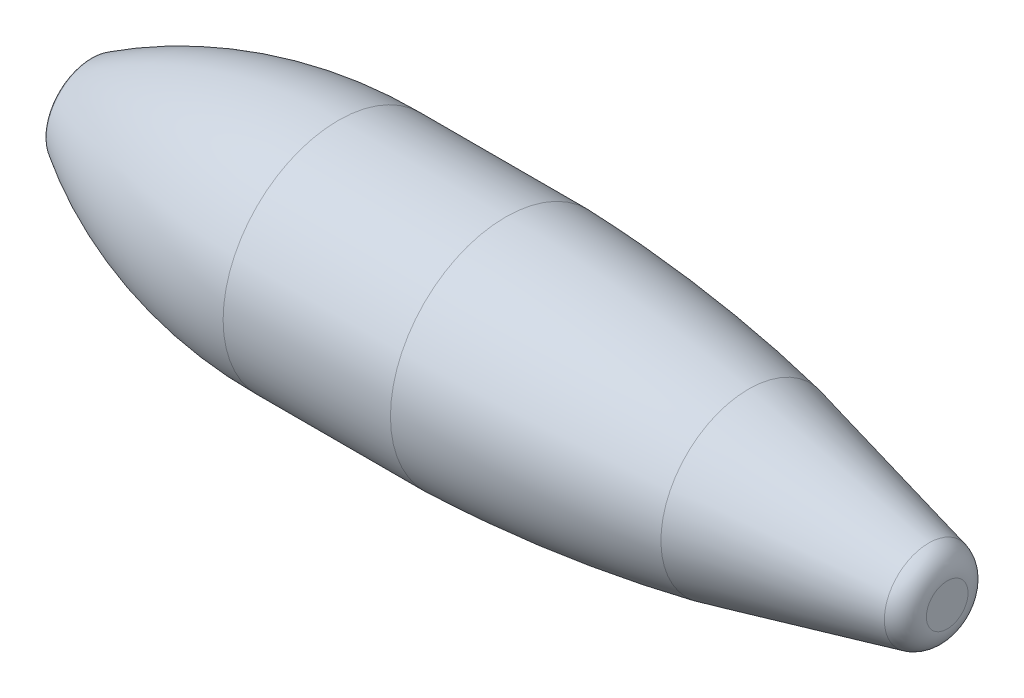
ISO-10303-21;
HEADER;
FILE_DESCRIPTION(('STEP AP214'),'2;1');
FILE_NAME('part.step','',(''),(''),'','','');
FILE_SCHEMA(('AUTOMOTIVE_DESIGN { 1 0 10303 214 1 1 1 1 }'));
ENDSEC;
DATA;
#1=APPLICATION_CONTEXT('core data for automotive mechanical design processes');
#2=APPLICATION_PROTOCOL_DEFINITION('international standard','automotive_design',2000,#1);
#3=PRODUCT_CONTEXT('',#1,'mechanical');
#4=PRODUCT('Part','Part','',(#3));
#5=PRODUCT_RELATED_PRODUCT_CATEGORY('part','',(#4));
#6=PRODUCT_DEFINITION_FORMATION('','',#4);
#7=PRODUCT_DEFINITION_CONTEXT('part definition',#1,'design');
#8=PRODUCT_DEFINITION('design','',#6,#7);
#9=PRODUCT_DEFINITION_SHAPE('','',#8);
#10=(LENGTH_UNIT() NAMED_UNIT(*) SI_UNIT(.MILLI.,.METRE.));
#11=(NAMED_UNIT(*) PLANE_ANGLE_UNIT() SI_UNIT($,.RADIAN.));
#12=(NAMED_UNIT(*) SI_UNIT($,.STERADIAN.) SOLID_ANGLE_UNIT());
#13=UNCERTAINTY_MEASURE_WITH_UNIT(LENGTH_MEASURE(1.E-05),#10,'distance_accuracy_value','');
#14=(GEOMETRIC_REPRESENTATION_CONTEXT(3) GLOBAL_UNCERTAINTY_ASSIGNED_CONTEXT((#13)) GLOBAL_UNIT_ASSIGNED_CONTEXT((#10,
#11,#12)) REPRESENTATION_CONTEXT('',''));
#15=CARTESIAN_POINT('',(0.,0.,0.));
#16=DIRECTION('',(0.,0.,1.));
#17=DIRECTION('',(1.,0.,0.));
#18=AXIS2_PLACEMENT_3D('',#15,#16,#17);
#19=CARTESIAN_POINT('',(171.905,0.,0.));
#20=DIRECTION('',(1.,0.,0.));
#21=DIRECTION('',(0.,1.,0.));
#22=AXIS2_PLACEMENT_3D('',#19,#20,#21);
#23=PLANE('',#22);
#24=CARTESIAN_POINT('',(171.905,0.,0.));
#25=DIRECTION('',(1.,0.,0.));
#26=DIRECTION('',(0.,1.,0.));
#27=AXIS2_PLACEMENT_3D('',#24,#25,#26);
#28=CIRCLE('',#27,8.61528574166076);
#29=CARTESIAN_POINT('',(171.905,8.61528574166075,0.));
#30=VERTEX_POINT('',#29);
#31=EDGE_CURVE('E10',#30,#30,#28,.T.);
#32=ORIENTED_EDGE('',*,*,#31,.T.);
#33=EDGE_LOOP('',(#32));
#34=FACE_BOUND('',#33,.T.);
#35=ADVANCED_FACE('F31',(#34),#23,.T.);
#36=CARTESIAN_POINT('',(161.905,0.,0.));
#37=DIRECTION('',(1.,0.,0.));
#38=DIRECTION('',(0.,1.,0.));
#39=AXIS2_PLACEMENT_3D('',#36,#37,#38);
#40=DEGENERATE_TOROIDAL_SURFACE('',#39,8.61528574166081,10.,.T.);
#41=CARTESIAN_POINT('',(164.237834674445,0.,0.));
#42=DIRECTION('',(1.,0.,0.));
#43=DIRECTION('',(0.,1.,0.));
#44=AXIS2_PLACEMENT_3D('',#41,#42,#43);
#45=CIRCLE('',#44,18.3393734819945);
#46=CARTESIAN_POINT('',(164.237834674445,18.3393734819945,0.));
#47=VERTEX_POINT('',#46);
#48=EDGE_CURVE('E37',#47,#47,#45,.T.);
#49=ORIENTED_EDGE('',*,*,#48,.T.);
#50=EDGE_LOOP('',(#49));
#51=FACE_BOUND('',#50,.T.);
#52=ORIENTED_EDGE('',*,*,#31,.F.);
#53=EDGE_LOOP('',(#52));
#54=FACE_BOUND('',#53,.T.);
#55=ADVANCED_FACE('F72',(#51,#54),#40,.T.);
#56=CARTESIAN_POINT('',(164.237834674445,0.,0.));
#57=DIRECTION('',(-1.,0.,0.));
#58=DIRECTION('',(0.,-1.,0.));
#59=AXIS2_PLACEMENT_3D('',#56,#57,#58);
#60=CONICAL_SURFACE('',#59,18.3393734819945,0.235452955616675);
#61=CARTESIAN_POINT('',(89.7049999999999,0.,0.));
#62=DIRECTION('',(1.,0.,0.));
#63=DIRECTION('',(0.,1.,0.));
#64=AXIS2_PLACEMENT_3D('',#61,#62,#63);
#65=CIRCLE('',#64,36.22);
#66=CARTESIAN_POINT('',(89.7049999999999,36.22,0.));
#67=VERTEX_POINT('',#66);
#68=EDGE_CURVE('E41',#67,#67,#65,.T.);
#69=ORIENTED_EDGE('',*,*,#68,.T.);
#70=EDGE_LOOP('',(#69));
#71=FACE_BOUND('',#70,.T.);
#72=ORIENTED_EDGE('',*,*,#48,.F.);
#73=EDGE_LOOP('',(#72));
#74=FACE_BOUND('',#73,.T.);
#75=ADVANCED_FACE('F76',(#71,#74),#60,.T.);
#76=CARTESIAN_POINT('',(-30.7217353090551,0.,0.));
#77=DIRECTION('',(1.,0.,0.));
#78=DIRECTION('',(0.,1.,0.));
#79=AXIS2_PLACEMENT_3D('',#76,#77,#78);
#80=DEGENERATE_TOROIDAL_SURFACE('',#79,576.161166858357,624.11,.F.);
#81=CARTESIAN_POINT('',(-10.775,0.,0.));
#82=DIRECTION('',(1.,0.,0.));
#83=DIRECTION('',(0.,1.,0.));
#84=AXIS2_PLACEMENT_3D('',#81,#82,#83);
#85=CIRCLE('',#84,47.63);
#86=CARTESIAN_POINT('',(-10.775,47.63,0.));
#87=VERTEX_POINT('',#86);
#88=EDGE_CURVE('E45',#87,#87,#85,.T.);
#89=ORIENTED_EDGE('',*,*,#88,.T.);
#90=EDGE_LOOP('',(#89));
#91=FACE_BOUND('',#90,.T.);
#92=ORIENTED_EDGE('',*,*,#68,.F.);
#93=EDGE_LOOP('',(#92));
#94=FACE_BOUND('',#93,.T.);
#95=ADVANCED_FACE('F80',(#91,#94),#80,.F.);
#96=CARTESIAN_POINT('',(171.905,0.,0.));
#97=DIRECTION('',(1.,0.,0.));
#98=DIRECTION('',(0.,1.,0.));
#99=AXIS2_PLACEMENT_3D('',#96,#97,#98);
#100=CYLINDRICAL_SURFACE('',#99,47.63);
#101=CARTESIAN_POINT('',(-79.995,0.,0.));
#102=DIRECTION('',(1.,0.,0.));
#103=DIRECTION('',(0.,1.,0.));
#104=AXIS2_PLACEMENT_3D('',#101,#102,#103);
#105=CIRCLE('',#104,47.63);
#106=CARTESIAN_POINT('',(-79.995,47.63,0.));
#107=VERTEX_POINT('',#106);
#108=EDGE_CURVE('E50',#107,#107,#105,.T.);
#109=ORIENTED_EDGE('',*,*,#108,.T.);
#110=EDGE_LOOP('',(#109));
#111=FACE_BOUND('',#110,.T.);
#112=ORIENTED_EDGE('',*,*,#88,.F.);
#113=EDGE_LOOP('',(#112));
#114=FACE_BOUND('',#113,.T.);
#115=ADVANCED_FACE('F87',(#111,#114),#100,.T.);
#116=CARTESIAN_POINT('',(-81.1844059141401,0.,0.));
#117=DIRECTION('',(1.,0.,0.));
#118=DIRECTION('',(0.,1.,0.));
#119=AXIS2_PLACEMENT_3D('',#116,#117,#118);
#120=DEGENERATE_TOROIDAL_SURFACE('',#119,143.996308771973,191.63,.F.);
#121=CARTESIAN_POINT('',(-181.597791569387,0.,0.));
#122=DIRECTION('',(1.,0.,0.));
#123=DIRECTION('',(0.,1.,0.));
#124=AXIS2_PLACEMENT_3D('',#121,#122,#123);
#125=CIRCLE('',#124,19.2189138062254);
#126=CARTESIAN_POINT('',(-181.597791569387,19.2189138062254,0.));
#127=VERTEX_POINT('',#126);
#128=EDGE_CURVE('E53',#127,#127,#125,.T.);
#129=ORIENTED_EDGE('',*,*,#128,.T.);
#130=EDGE_LOOP('',(#129));
#131=FACE_BOUND('',#130,.T.);
#132=ORIENTED_EDGE('',*,*,#108,.F.);
#133=EDGE_LOOP('',(#132));
#134=FACE_BOUND('',#133,.T.);
#135=ADVANCED_FACE('F69',(#131,#134),#120,.F.);
#136=CARTESIAN_POINT('',(-180.445,0.,0.));
#137=DIRECTION('',(1.,0.,0.));
#138=DIRECTION('',(0.,1.,0.));
#139=AXIS2_PLACEMENT_3D('',#136,#137,#138);
#140=TOROIDAL_SURFACE('',#139,17.3451284403013,2.20000000000001);
#141=CARTESIAN_POINT('',(-182.645,0.,0.));
#142=DIRECTION('',(1.,0.,0.));
#143=DIRECTION('',(0.,1.,0.));
#144=AXIS2_PLACEMENT_3D('',#141,#142,#143);
#145=CIRCLE('',#144,17.3451284403013);
#146=CARTESIAN_POINT('',(-182.645,17.3451284403013,0.));
#147=VERTEX_POINT('',#146);
#148=EDGE_CURVE('E56',#147,#147,#145,.T.);
#149=ORIENTED_EDGE('',*,*,#148,.T.);
#150=EDGE_LOOP('',(#149));
#151=FACE_BOUND('',#150,.T.);
#152=ORIENTED_EDGE('',*,*,#128,.F.);
#153=EDGE_LOOP('',(#152));
#154=FACE_BOUND('',#153,.T.);
#155=ADVANCED_FACE('F60',(#151,#154),#140,.T.);
#156=CARTESIAN_POINT('',(-182.645,14.5,0.));
#157=DIRECTION('',(-1.,0.,0.));
#158=DIRECTION('',(0.,-1.,0.));
#159=AXIS2_PLACEMENT_3D('',#156,#157,#158);
#160=PLANE('',#159);
#161=ORIENTED_EDGE('',*,*,#148,.F.);
#162=EDGE_LOOP('',(#161));
#163=FACE_BOUND('',#162,.T.);
#164=ADVANCED_FACE('F63',(#163),#160,.T.);
#165=CLOSED_SHELL('',(#35,#55,#75,#95,#115,#135,#155,#164));
#166=MANIFOLD_SOLID_BREP('B2',#165);
#167=ADVANCED_BREP_SHAPE_REPRESENTATION('',(#18,#166),#14);
#168=SHAPE_DEFINITION_REPRESENTATION(#9,#167);
ENDSEC;
END-ISO-10303-21;
